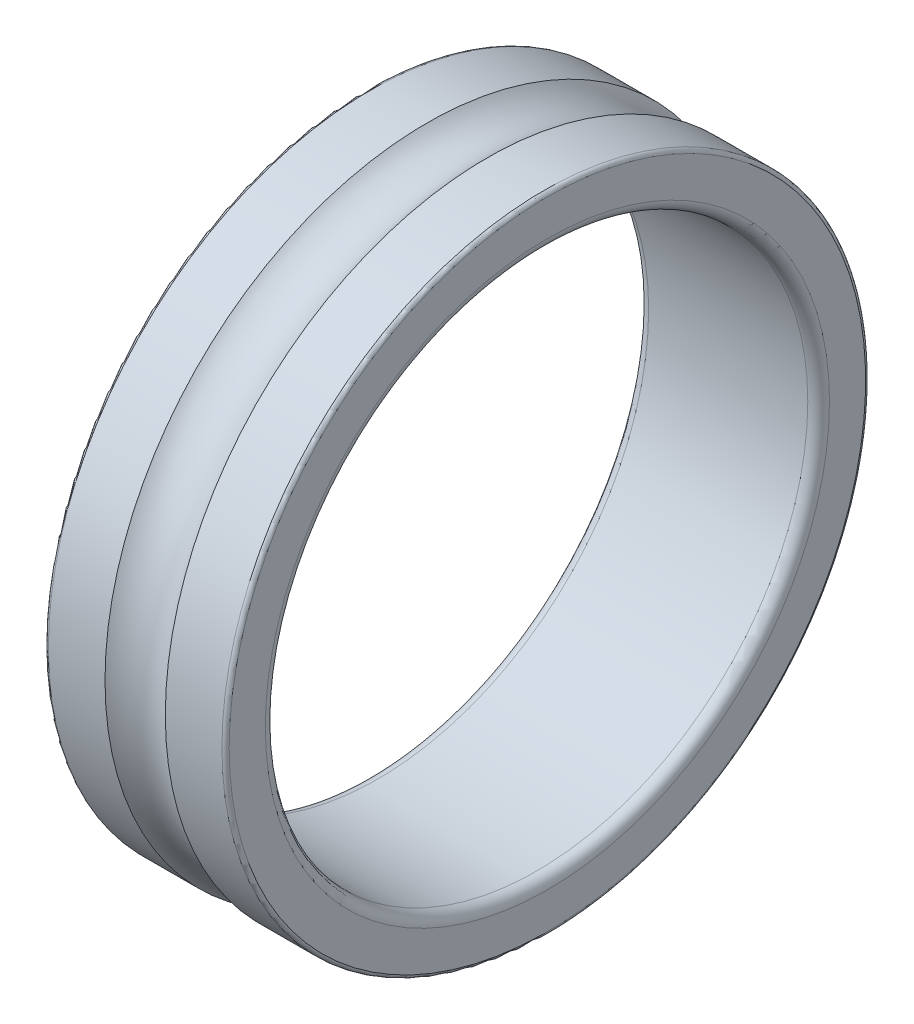
ISO-10303-21;
HEADER;
FILE_DESCRIPTION(('STEP AP214'),'2;1');
FILE_NAME('part.step','',(''),(''),'','','');
FILE_SCHEMA(('AUTOMOTIVE_DESIGN { 1 0 10303 214 1 1 1 1 }'));
ENDSEC;
DATA;
#1=APPLICATION_CONTEXT('core data for automotive mechanical design processes');
#2=APPLICATION_PROTOCOL_DEFINITION('international standard','automotive_design',2000,#1);
#3=PRODUCT_CONTEXT('',#1,'mechanical');
#4=PRODUCT('Part','Part','',(#3));
#5=PRODUCT_RELATED_PRODUCT_CATEGORY('part','',(#4));
#6=PRODUCT_DEFINITION_FORMATION('','',#4);
#7=PRODUCT_DEFINITION_CONTEXT('part definition',#1,'design');
#8=PRODUCT_DEFINITION('design','',#6,#7);
#9=PRODUCT_DEFINITION_SHAPE('','',#8);
#10=(LENGTH_UNIT() NAMED_UNIT(*) SI_UNIT(.MILLI.,.METRE.));
#11=(NAMED_UNIT(*) PLANE_ANGLE_UNIT() SI_UNIT($,.RADIAN.));
#12=(NAMED_UNIT(*) SI_UNIT($,.STERADIAN.) SOLID_ANGLE_UNIT());
#13=UNCERTAINTY_MEASURE_WITH_UNIT(LENGTH_MEASURE(1.E-05),#10,'distance_accuracy_value','');
#14=(GEOMETRIC_REPRESENTATION_CONTEXT(3) GLOBAL_UNCERTAINTY_ASSIGNED_CONTEXT((#13)) GLOBAL_UNIT_ASSIGNED_CONTEXT((#10,
#11,#12)) REPRESENTATION_CONTEXT('',''));
#15=CARTESIAN_POINT('',(0.,0.,0.));
#16=DIRECTION('',(0.,0.,1.));
#17=DIRECTION('',(1.,0.,0.));
#18=AXIS2_PLACEMENT_3D('',#15,#16,#17);
#19=CARTESIAN_POINT('',(0.0999999999999222,0.,0.));
#20=DIRECTION('',(-1.,0.,0.));
#21=DIRECTION('',(0.,0.,1.));
#22=AXIS2_PLACEMENT_3D('',#19,#20,#21);
#23=TOROIDAL_SURFACE('',#22,8.80000000000008,0.0999999999999227);
#24=CARTESIAN_POINT('',(0.,0.,0.));
#25=DIRECTION('',(-1.,0.,0.));
#26=DIRECTION('',(0.,0.,1.));
#27=AXIS2_PLACEMENT_3D('',#24,#25,#26);
#28=CIRCLE('',#27,8.8);
#29=CARTESIAN_POINT('',(0.,0.,8.8));
#30=VERTEX_POINT('',#29);
#31=EDGE_CURVE('E10',#30,#30,#28,.T.);
#32=ORIENTED_EDGE('',*,*,#31,.F.);
#33=EDGE_LOOP('',(#32));
#34=FACE_BOUND('',#33,.T.);
#35=CARTESIAN_POINT('',(0.100000000000003,0.,0.));
#36=DIRECTION('',(-1.,0.,0.));
#37=DIRECTION('',(0.,0.,1.));
#38=AXIS2_PLACEMENT_3D('',#35,#36,#37);
#39=CIRCLE('',#38,8.9);
#40=CARTESIAN_POINT('',(0.100000000000003,0.,8.9));
#41=VERTEX_POINT('',#40);
#42=EDGE_CURVE('E67',#41,#41,#39,.T.);
#43=ORIENTED_EDGE('',*,*,#42,.T.);
#44=EDGE_LOOP('',(#43));
#45=FACE_BOUND('',#44,.T.);
#46=ADVANCED_FACE('F33',(#34,#45),#23,.T.);
#47=CARTESIAN_POINT('',(0.,8.8,0.));
#48=DIRECTION('',(1.,0.,0.));
#49=DIRECTION('',(0.,0.,-1.));
#50=AXIS2_PLACEMENT_3D('',#47,#48,#49);
#51=PLANE('',#50);
#52=CARTESIAN_POINT('',(0.,0.,0.));
#53=DIRECTION('',(-1.,0.,0.));
#54=DIRECTION('',(0.,0.,1.));
#55=AXIS2_PLACEMENT_3D('',#52,#53,#54);
#56=CIRCLE('',#55,7.8);
#57=CARTESIAN_POINT('',(0.,0.,7.8));
#58=VERTEX_POINT('',#57);
#59=EDGE_CURVE('E39',#58,#58,#56,.T.);
#60=ORIENTED_EDGE('',*,*,#59,.F.);
#61=EDGE_LOOP('',(#60));
#62=FACE_BOUND('',#61,.T.);
#63=ORIENTED_EDGE('',*,*,#31,.T.);
#64=EDGE_LOOP('',(#63));
#65=FACE_BOUND('',#64,.T.);
#66=ADVANCED_FACE('F116',(#62,#65),#51,.F.);
#67=CARTESIAN_POINT('',(0.299999999999941,0.,0.));
#68=DIRECTION('',(-1.,0.,0.));
#69=DIRECTION('',(0.,0.,1.));
#70=AXIS2_PLACEMENT_3D('',#67,#68,#69);
#71=TOROIDAL_SURFACE('',#70,7.79999999999994,0.299999999999941);
#72=CARTESIAN_POINT('',(0.300000000000002,0.,0.));
#73=DIRECTION('',(-1.,0.,0.));
#74=DIRECTION('',(0.,0.,1.));
#75=AXIS2_PLACEMENT_3D('',#72,#73,#74);
#76=CIRCLE('',#75,7.5);
#77=CARTESIAN_POINT('',(0.300000000000002,0.,7.5));
#78=VERTEX_POINT('',#77);
#79=EDGE_CURVE('E43',#78,#78,#76,.T.);
#80=ORIENTED_EDGE('',*,*,#79,.F.);
#81=EDGE_LOOP('',(#80));
#82=FACE_BOUND('',#81,.T.);
#83=ORIENTED_EDGE('',*,*,#59,.T.);
#84=EDGE_LOOP('',(#83));
#85=FACE_BOUND('',#84,.T.);
#86=ADVANCED_FACE('F111',(#82,#85),#71,.T.);
#87=CARTESIAN_POINT('',(50.,0.,0.));
#88=DIRECTION('',(-1.,0.,0.));
#89=DIRECTION('',(0.,0.,1.));
#90=AXIS2_PLACEMENT_3D('',#87,#88,#89);
#91=CYLINDRICAL_SURFACE('',#90,7.5);
#92=CARTESIAN_POINT('',(4.7,0.,0.));
#93=DIRECTION('',(-1.,0.,0.));
#94=DIRECTION('',(0.,0.,1.));
#95=AXIS2_PLACEMENT_3D('',#92,#93,#94);
#96=CIRCLE('',#95,7.5);
#97=CARTESIAN_POINT('',(4.7,0.,7.5));
#98=VERTEX_POINT('',#97);
#99=EDGE_CURVE('E47',#98,#98,#96,.T.);
#100=ORIENTED_EDGE('',*,*,#99,.F.);
#101=EDGE_LOOP('',(#100));
#102=FACE_BOUND('',#101,.T.);
#103=ORIENTED_EDGE('',*,*,#79,.T.);
#104=EDGE_LOOP('',(#103));
#105=FACE_BOUND('',#104,.T.);
#106=ADVANCED_FACE('F105',(#102,#105),#91,.F.);
#107=CARTESIAN_POINT('',(4.70000000000012,0.,0.));
#108=DIRECTION('',(-1.,0.,0.));
#109=DIRECTION('',(0.,0.,1.));
#110=AXIS2_PLACEMENT_3D('',#107,#108,#109);
#111=TOROIDAL_SURFACE('',#110,7.79999999999988,0.299999999999879);
#112=CARTESIAN_POINT('',(5.,0.,0.));
#113=DIRECTION('',(-1.,0.,0.));
#114=DIRECTION('',(0.,0.,1.));
#115=AXIS2_PLACEMENT_3D('',#112,#113,#114);
#116=CIRCLE('',#115,7.8);
#117=CARTESIAN_POINT('',(5.,0.,7.8));
#118=VERTEX_POINT('',#117);
#119=EDGE_CURVE('E52',#118,#118,#116,.T.);
#120=ORIENTED_EDGE('',*,*,#119,.F.);
#121=EDGE_LOOP('',(#120));
#122=FACE_BOUND('',#121,.T.);
#123=ORIENTED_EDGE('',*,*,#99,.T.);
#124=EDGE_LOOP('',(#123));
#125=FACE_BOUND('',#124,.T.);
#126=ADVANCED_FACE('F99',(#122,#125),#111,.T.);
#127=CARTESIAN_POINT('',(5.,7.8,0.));
#128=DIRECTION('',(-1.,0.,0.));
#129=DIRECTION('',(0.,0.,1.));
#130=AXIS2_PLACEMENT_3D('',#127,#128,#129);
#131=PLANE('',#130);
#132=CARTESIAN_POINT('',(5.,0.,0.));
#133=DIRECTION('',(-1.,0.,0.));
#134=DIRECTION('',(0.,0.,1.));
#135=AXIS2_PLACEMENT_3D('',#132,#133,#134);
#136=CIRCLE('',#135,8.8);
#137=CARTESIAN_POINT('',(5.,0.,8.8));
#138=VERTEX_POINT('',#137);
#139=EDGE_CURVE('E55',#138,#138,#136,.T.);
#140=ORIENTED_EDGE('',*,*,#139,.F.);
#141=EDGE_LOOP('',(#140));
#142=FACE_BOUND('',#141,.T.);
#143=ORIENTED_EDGE('',*,*,#119,.T.);
#144=EDGE_LOOP('',(#143));
#145=FACE_BOUND('',#144,.T.);
#146=ADVANCED_FACE('F93',(#142,#145),#131,.F.);
#147=CARTESIAN_POINT('',(4.90000000000015,0.,0.));
#148=DIRECTION('',(-1.,0.,0.));
#149=DIRECTION('',(0.,0.,1.));
#150=AXIS2_PLACEMENT_3D('',#147,#148,#149);
#151=TOROIDAL_SURFACE('',#150,8.80000000000015,0.0999999999998463);
#152=CARTESIAN_POINT('',(4.9,0.,0.));
#153=DIRECTION('',(-1.,0.,0.));
#154=DIRECTION('',(0.,0.,1.));
#155=AXIS2_PLACEMENT_3D('',#152,#153,#154);
#156=CIRCLE('',#155,8.9);
#157=CARTESIAN_POINT('',(4.9,0.,8.9));
#158=VERTEX_POINT('',#157);
#159=EDGE_CURVE('E58',#158,#158,#156,.T.);
#160=ORIENTED_EDGE('',*,*,#159,.F.);
#161=EDGE_LOOP('',(#160));
#162=FACE_BOUND('',#161,.T.);
#163=ORIENTED_EDGE('',*,*,#139,.T.);
#164=EDGE_LOOP('',(#163));
#165=FACE_BOUND('',#164,.T.);
#166=ADVANCED_FACE('F87',(#162,#165),#151,.T.);
#167=CARTESIAN_POINT('',(50.,0.,0.));
#168=DIRECTION('',(-1.,0.,0.));
#169=DIRECTION('',(0.,0.,1.));
#170=AXIS2_PLACEMENT_3D('',#167,#168,#169);
#171=CYLINDRICAL_SURFACE('',#170,8.9);
#172=CARTESIAN_POINT('',(3.3335407908435,0.,0.));
#173=DIRECTION('',(-1.,0.,0.));
#174=DIRECTION('',(0.,0.,1.));
#175=AXIS2_PLACEMENT_3D('',#172,#173,#174);
#176=CIRCLE('',#175,8.9);
#177=CARTESIAN_POINT('',(3.3335407908435,0.,8.9));
#178=VERTEX_POINT('',#177);
#179=EDGE_CURVE('E61',#178,#178,#176,.T.);
#180=ORIENTED_EDGE('',*,*,#179,.F.);
#181=EDGE_LOOP('',(#180));
#182=FACE_BOUND('',#181,.T.);
#183=ORIENTED_EDGE('',*,*,#159,.T.);
#184=EDGE_LOOP('',(#183));
#185=FACE_BOUND('',#184,.T.);
#186=ADVANCED_FACE('F81',(#182,#185),#171,.T.);
#187=CARTESIAN_POINT('',(2.5,0.,0.));
#188=DIRECTION('',(-1.,0.,0.));
#189=DIRECTION('',(0.,0.,1.));
#190=AXIS2_PLACEMENT_3D('',#187,#188,#189);
#191=TOROIDAL_SURFACE('',#190,9.75000000000001,1.19050000000001);
#192=CARTESIAN_POINT('',(1.6664592091565,0.,0.));
#193=DIRECTION('',(-1.,0.,0.));
#194=DIRECTION('',(0.,0.,1.));
#195=AXIS2_PLACEMENT_3D('',#192,#193,#194);
#196=CIRCLE('',#195,8.9);
#197=CARTESIAN_POINT('',(1.6664592091565,0.,8.9));
#198=VERTEX_POINT('',#197);
#199=EDGE_CURVE('E64',#198,#198,#196,.T.);
#200=ORIENTED_EDGE('',*,*,#199,.F.);
#201=EDGE_LOOP('',(#200));
#202=FACE_BOUND('',#201,.T.);
#203=ORIENTED_EDGE('',*,*,#179,.T.);
#204=EDGE_LOOP('',(#203));
#205=FACE_BOUND('',#204,.T.);
#206=ADVANCED_FACE('F75',(#202,#205),#191,.F.);
#207=CARTESIAN_POINT('',(50.,0.,0.));
#208=DIRECTION('',(-1.,0.,0.));
#209=DIRECTION('',(0.,0.,1.));
#210=AXIS2_PLACEMENT_3D('',#207,#208,#209);
#211=CYLINDRICAL_SURFACE('',#210,8.9);
#212=ORIENTED_EDGE('',*,*,#42,.F.);
#213=EDGE_LOOP('',(#212));
#214=FACE_BOUND('',#213,.T.);
#215=ORIENTED_EDGE('',*,*,#199,.T.);
#216=EDGE_LOOP('',(#215));
#217=FACE_BOUND('',#216,.T.);
#218=ADVANCED_FACE('F72',(#214,#217),#211,.T.);
#219=CLOSED_SHELL('',(#46,#66,#86,#106,#126,#146,#166,#186,#206,#218));
#220=MANIFOLD_SOLID_BREP('B2',#219);
#221=ADVANCED_BREP_SHAPE_REPRESENTATION('',(#18,#220),#14);
#222=SHAPE_DEFINITION_REPRESENTATION(#9,#221);
ENDSEC;
END-ISO-10303-21;
